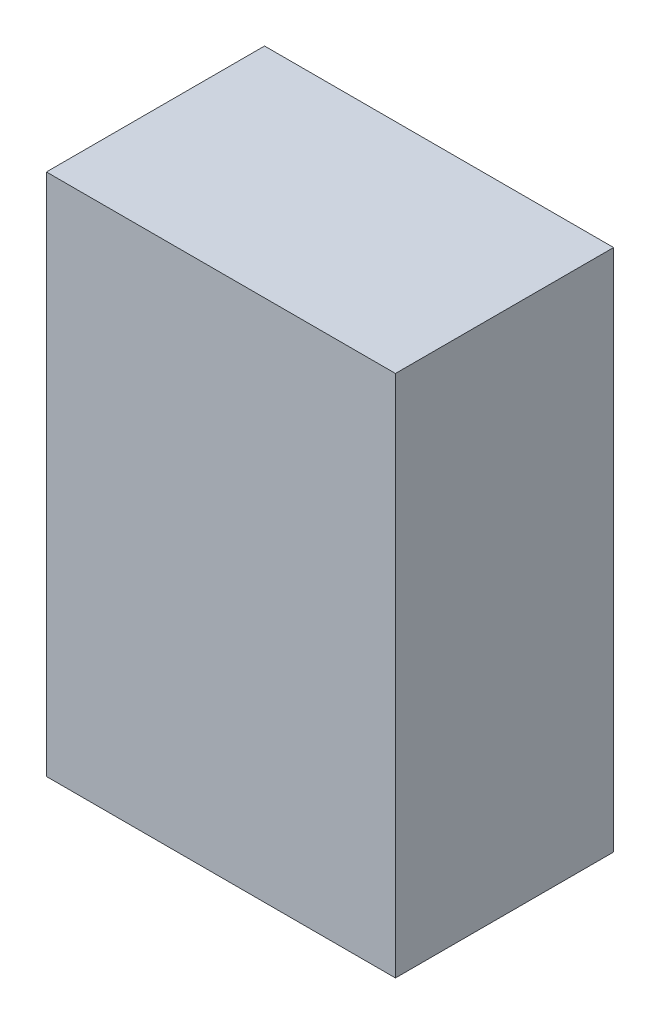
ISO-10303-21;
HEADER;
FILE_DESCRIPTION(('STEP AP214'),'2;1');
FILE_NAME('part.step','',(''),(''),'','','');
FILE_SCHEMA(('AUTOMOTIVE_DESIGN { 1 0 10303 214 1 1 1 1 }'));
ENDSEC;
DATA;
#1=APPLICATION_CONTEXT('core data for automotive mechanical design processes');
#2=APPLICATION_PROTOCOL_DEFINITION('international standard','automotive_design',2000,#1);
#3=PRODUCT_CONTEXT('',#1,'mechanical');
#4=PRODUCT('Part','Part','',(#3));
#5=PRODUCT_RELATED_PRODUCT_CATEGORY('part','',(#4));
#6=PRODUCT_DEFINITION_FORMATION('','',#4);
#7=PRODUCT_DEFINITION_CONTEXT('part definition',#1,'design');
#8=PRODUCT_DEFINITION('design','',#6,#7);
#9=PRODUCT_DEFINITION_SHAPE('','',#8);
#10=(LENGTH_UNIT() NAMED_UNIT(*) SI_UNIT(.MILLI.,.METRE.));
#11=(NAMED_UNIT(*) PLANE_ANGLE_UNIT() SI_UNIT($,.RADIAN.));
#12=(NAMED_UNIT(*) SI_UNIT($,.STERADIAN.) SOLID_ANGLE_UNIT());
#13=UNCERTAINTY_MEASURE_WITH_UNIT(LENGTH_MEASURE(1.E-05),#10,'distance_accuracy_value','');
#14=(GEOMETRIC_REPRESENTATION_CONTEXT(3) GLOBAL_UNCERTAINTY_ASSIGNED_CONTEXT((#13)) GLOBAL_UNIT_ASSIGNED_CONTEXT((#10,
#11,#12)) REPRESENTATION_CONTEXT('',''));
#15=CARTESIAN_POINT('',(0.,0.,0.));
#16=DIRECTION('',(0.,0.,1.));
#17=DIRECTION('',(1.,0.,0.));
#18=AXIS2_PLACEMENT_3D('',#15,#16,#17);
#19=CARTESIAN_POINT('',(4000.,-8000.,2500.));
#20=DIRECTION('',(1.,0.,0.));
#21=DIRECTION('',(0.,0.,-1.));
#22=AXIS2_PLACEMENT_3D('',#19,#20,#21);
#23=PLANE('',#22);
#24=DIRECTION('',(0.,1.,0.));
#25=VECTOR('',#24,1.);
#26=CARTESIAN_POINT('',(4000.,-8000.,-2500.));
#27=LINE('',#26,#25);
#28=CARTESIAN_POINT('',(4000.,-8000.,-2500.));
#29=VERTEX_POINT('',#28);
#30=CARTESIAN_POINT('',(4000.,4000.00000000001,-2500.));
#31=VERTEX_POINT('',#30);
#32=EDGE_CURVE('E40',#29,#31,#27,.T.);
#33=ORIENTED_EDGE('',*,*,#32,.T.);
#34=DIRECTION('',(0.,0.,-1.));
#35=VECTOR('',#34,1.);
#36=CARTESIAN_POINT('',(4000.,4000.00000000001,2500.));
#37=LINE('',#36,#35);
#38=CARTESIAN_POINT('',(4000.,4000.00000000001,2500.));
#39=VERTEX_POINT('',#38);
#40=EDGE_CURVE('E77',#39,#31,#37,.T.);
#41=ORIENTED_EDGE('',*,*,#40,.F.);
#42=DIRECTION('',(0.,1.,0.));
#43=VECTOR('',#42,1.);
#44=CARTESIAN_POINT('',(4000.,-8000.,2500.));
#45=LINE('',#44,#43);
#46=CARTESIAN_POINT('',(4000.,-8000.,2500.));
#47=VERTEX_POINT('',#46);
#48=EDGE_CURVE('E11',#47,#39,#45,.T.);
#49=ORIENTED_EDGE('',*,*,#48,.F.);
#50=DIRECTION('',(0.,0.,-1.));
#51=VECTOR('',#50,1.);
#52=CARTESIAN_POINT('',(4000.,-8000.,2500.));
#53=LINE('',#52,#51);
#54=EDGE_CURVE('E78',#47,#29,#53,.T.);
#55=ORIENTED_EDGE('',*,*,#54,.T.);
#56=EDGE_LOOP('',(#33,#41,#49,#55));
#57=FACE_BOUND('',#56,.T.);
#58=ADVANCED_FACE('F37',(#57),#23,.T.);
#59=CARTESIAN_POINT('',(-4000.,-8000.,2500.));
#60=DIRECTION('',(0.,0.,1.));
#61=DIRECTION('',(1.,0.,0.));
#62=AXIS2_PLACEMENT_3D('',#59,#60,#61);
#63=PLANE('',#62);
#64=ORIENTED_EDGE('',*,*,#48,.T.);
#65=DIRECTION('',(1.,0.,0.));
#66=VECTOR('',#65,1.);
#67=CARTESIAN_POINT('',(-4000.,4000.00000000001,2500.));
#68=LINE('',#67,#66);
#69=CARTESIAN_POINT('',(-4000.,4000.00000000001,2500.));
#70=VERTEX_POINT('',#69);
#71=EDGE_CURVE('E94',#70,#39,#68,.T.);
#72=ORIENTED_EDGE('',*,*,#71,.F.);
#73=DIRECTION('',(0.,1.,0.));
#74=VECTOR('',#73,1.);
#75=CARTESIAN_POINT('',(-4000.,-8000.,2500.));
#76=LINE('',#75,#74);
#77=CARTESIAN_POINT('',(-4000.,-8000.,2500.));
#78=VERTEX_POINT('',#77);
#79=EDGE_CURVE('E45',#78,#70,#76,.T.);
#80=ORIENTED_EDGE('',*,*,#79,.F.);
#81=DIRECTION('',(1.,0.,0.));
#82=VECTOR('',#81,1.);
#83=CARTESIAN_POINT('',(-4000.,-8000.,2500.));
#84=LINE('',#83,#82);
#85=EDGE_CURVE('E83',#78,#47,#84,.T.);
#86=ORIENTED_EDGE('',*,*,#85,.T.);
#87=EDGE_LOOP('',(#64,#72,#80,#86));
#88=FACE_BOUND('',#87,.T.);
#89=ADVANCED_FACE('F109',(#88),#63,.T.);
#90=CARTESIAN_POINT('',(-4000.,-8000.,2500.));
#91=DIRECTION('',(-1.,0.,0.));
#92=DIRECTION('',(0.,0.,1.));
#93=AXIS2_PLACEMENT_3D('',#90,#91,#92);
#94=PLANE('',#93);
#95=ORIENTED_EDGE('',*,*,#79,.T.);
#96=DIRECTION('',(0.,0.,1.));
#97=VECTOR('',#96,1.);
#98=CARTESIAN_POINT('',(-4000.,4000.00000000001,2500.));
#99=LINE('',#98,#97);
#100=CARTESIAN_POINT('',(-4000.,4000.00000000001,-2500.));
#101=VERTEX_POINT('',#100);
#102=EDGE_CURVE('E90',#101,#70,#99,.T.);
#103=ORIENTED_EDGE('',*,*,#102,.F.);
#104=DIRECTION('',(0.,1.,0.));
#105=VECTOR('',#104,1.);
#106=CARTESIAN_POINT('',(-4000.,-8000.,-2500.));
#107=LINE('',#106,#105);
#108=CARTESIAN_POINT('',(-4000.,-8000.,-2500.));
#109=VERTEX_POINT('',#108);
#110=EDGE_CURVE('E82',#109,#101,#107,.T.);
#111=ORIENTED_EDGE('',*,*,#110,.F.);
#112=DIRECTION('',(0.,0.,1.));
#113=VECTOR('',#112,1.);
#114=CARTESIAN_POINT('',(-4000.,-8000.,2500.));
#115=LINE('',#114,#113);
#116=EDGE_CURVE('E102',#109,#78,#115,.T.);
#117=ORIENTED_EDGE('',*,*,#116,.T.);
#118=EDGE_LOOP('',(#95,#103,#111,#117));
#119=FACE_BOUND('',#118,.T.);
#120=ADVANCED_FACE('F106',(#119),#94,.T.);
#121=CARTESIAN_POINT('',(-4000.,-8000.,-2500.));
#122=DIRECTION('',(0.,0.,-1.));
#123=DIRECTION('',(-1.,0.,0.));
#124=AXIS2_PLACEMENT_3D('',#121,#122,#123);
#125=PLANE('',#124);
#126=ORIENTED_EDGE('',*,*,#110,.T.);
#127=DIRECTION('',(-1.,0.,0.));
#128=VECTOR('',#127,1.);
#129=CARTESIAN_POINT('',(-4000.,4000.00000000001,-2500.));
#130=LINE('',#129,#128);
#131=EDGE_CURVE('E85',#31,#101,#130,.T.);
#132=ORIENTED_EDGE('',*,*,#131,.F.);
#133=ORIENTED_EDGE('',*,*,#32,.F.);
#134=DIRECTION('',(-1.,0.,0.));
#135=VECTOR('',#134,1.);
#136=CARTESIAN_POINT('',(-4000.,-8000.,-2500.));
#137=LINE('',#136,#135);
#138=EDGE_CURVE('E100',#29,#109,#137,.T.);
#139=ORIENTED_EDGE('',*,*,#138,.T.);
#140=EDGE_LOOP('',(#126,#132,#133,#139));
#141=FACE_BOUND('',#140,.T.);
#142=ADVANCED_FACE('F86',(#141),#125,.T.);
#143=CARTESIAN_POINT('',(0.,-8000.,0.));
#144=DIRECTION('',(0.,-1.,0.));
#145=DIRECTION('',(0.,0.,-1.));
#146=AXIS2_PLACEMENT_3D('',#143,#144,#145);
#147=PLANE('',#146);
#148=ORIENTED_EDGE('',*,*,#54,.F.);
#149=ORIENTED_EDGE('',*,*,#85,.F.);
#150=ORIENTED_EDGE('',*,*,#116,.F.);
#151=ORIENTED_EDGE('',*,*,#138,.F.);
#152=EDGE_LOOP('',(#148,#149,#150,#151));
#153=FACE_BOUND('',#152,.T.);
#154=ADVANCED_FACE('F111',(#153),#147,.T.);
#155=CARTESIAN_POINT('',(0.,4000.00000000001,0.));
#156=DIRECTION('',(0.,-1.,0.));
#157=DIRECTION('',(0.,0.,-1.));
#158=AXIS2_PLACEMENT_3D('',#155,#156,#157);
#159=PLANE('',#158);
#160=ORIENTED_EDGE('',*,*,#40,.T.);
#161=ORIENTED_EDGE('',*,*,#131,.T.);
#162=ORIENTED_EDGE('',*,*,#102,.T.);
#163=ORIENTED_EDGE('',*,*,#71,.T.);
#164=EDGE_LOOP('',(#160,#161,#162,#163));
#165=FACE_BOUND('',#164,.T.);
#166=ADVANCED_FACE('F93',(#165),#159,.F.);
#167=CLOSED_SHELL('',(#58,#89,#120,#142,#154,#166));
#168=MANIFOLD_SOLID_BREP('B2',#167);
#169=ADVANCED_BREP_SHAPE_REPRESENTATION('',(#18,#168),#14);
#170=SHAPE_DEFINITION_REPRESENTATION(#9,#169);
ENDSEC;
END-ISO-10303-21;
